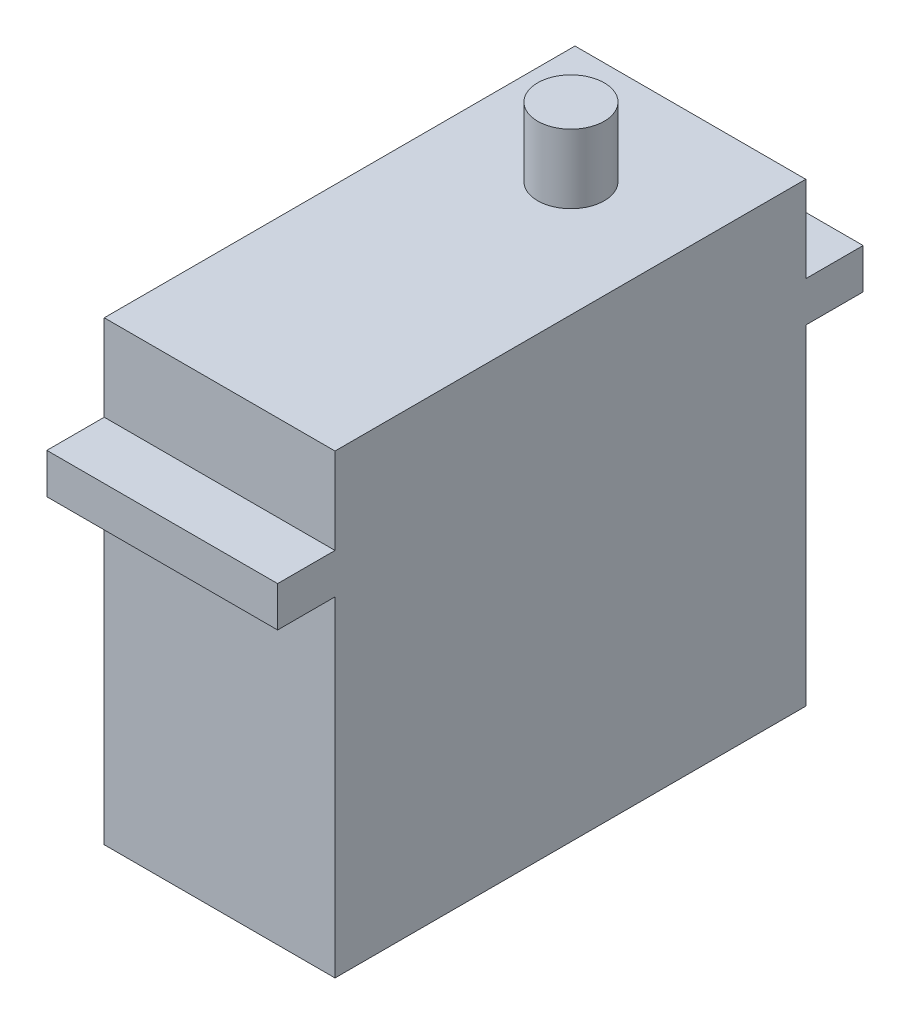
ISO-10303-21;
HEADER;
FILE_DESCRIPTION(('STEP AP214'),'2;1');
FILE_NAME('part.step','',(''),(''),'','','');
FILE_SCHEMA(('AUTOMOTIVE_DESIGN { 1 0 10303 214 1 1 1 1 }'));
ENDSEC;
DATA;
#1=APPLICATION_CONTEXT('core data for automotive mechanical design processes');
#2=APPLICATION_PROTOCOL_DEFINITION('international standard','automotive_design',2000,#1);
#3=PRODUCT_CONTEXT('',#1,'mechanical');
#4=PRODUCT('Part','Part','',(#3));
#5=PRODUCT_RELATED_PRODUCT_CATEGORY('part','',(#4));
#6=PRODUCT_DEFINITION_FORMATION('','',#4);
#7=PRODUCT_DEFINITION_CONTEXT('part definition',#1,'design');
#8=PRODUCT_DEFINITION('design','',#6,#7);
#9=PRODUCT_DEFINITION_SHAPE('','',#8);
#10=(LENGTH_UNIT() NAMED_UNIT(*) SI_UNIT(.MILLI.,.METRE.));
#11=(NAMED_UNIT(*) PLANE_ANGLE_UNIT() SI_UNIT($,.RADIAN.));
#12=(NAMED_UNIT(*) SI_UNIT($,.STERADIAN.) SOLID_ANGLE_UNIT());
#13=UNCERTAINTY_MEASURE_WITH_UNIT(LENGTH_MEASURE(1.E-05),#10,'distance_accuracy_value','');
#14=(GEOMETRIC_REPRESENTATION_CONTEXT(3) GLOBAL_UNCERTAINTY_ASSIGNED_CONTEXT((#13)) GLOBAL_UNIT_ASSIGNED_CONTEXT((#10,
#11,#12)) REPRESENTATION_CONTEXT('',''));
#15=CARTESIAN_POINT('',(0.,0.,0.));
#16=DIRECTION('',(0.,0.,1.));
#17=DIRECTION('',(1.,0.,0.));
#18=AXIS2_PLACEMENT_3D('',#15,#16,#17);
#19=CARTESIAN_POINT('',(20.1,0.,0.));
#20=DIRECTION('',(1.,0.,0.));
#21=DIRECTION('',(0.,0.,-1.));
#22=AXIS2_PLACEMENT_3D('',#19,#20,#21);
#23=PLANE('',#22);
#24=DIRECTION('',(0.,0.,-1.));
#25=VECTOR('',#24,1.);
#26=CARTESIAN_POINT('',(20.1,19.875,0.));
#27=LINE('',#26,#25);
#28=CARTESIAN_POINT('',(20.1,19.875,20.5));
#29=VERTEX_POINT('',#28);
#30=CARTESIAN_POINT('',(20.1,19.875,-20.5));
#31=VERTEX_POINT('',#30);
#32=EDGE_CURVE('E239',#29,#31,#27,.T.);
#33=ORIENTED_EDGE('',*,*,#32,.F.);
#34=DIRECTION('',(0.,-1.,0.));
#35=VECTOR('',#34,1.);
#36=CARTESIAN_POINT('',(20.1,0.,20.5));
#37=LINE('',#36,#35);
#38=CARTESIAN_POINT('',(20.1,12.375,20.5));
#39=VERTEX_POINT('',#38);
#40=EDGE_CURVE('E230',#29,#39,#37,.T.);
#41=ORIENTED_EDGE('',*,*,#40,.T.);
#42=DIRECTION('',(0.,0.,1.));
#43=VECTOR('',#42,1.);
#44=CARTESIAN_POINT('',(20.1,12.375,0.));
#45=LINE('',#44,#43);
#46=CARTESIAN_POINT('',(20.1,12.375,25.5));
#47=VERTEX_POINT('',#46);
#48=EDGE_CURVE('E306',#39,#47,#45,.T.);
#49=ORIENTED_EDGE('',*,*,#48,.T.);
#50=DIRECTION('',(0.,-1.,0.));
#51=VECTOR('',#50,1.);
#52=CARTESIAN_POINT('',(20.1,0.,25.5));
#53=LINE('',#52,#51);
#54=CARTESIAN_POINT('',(20.1,8.87500000000001,25.5));
#55=VERTEX_POINT('',#54);
#56=EDGE_CURVE('E302',#47,#55,#53,.T.);
#57=ORIENTED_EDGE('',*,*,#56,.T.);
#58=DIRECTION('',(0.,0.,1.));
#59=VECTOR('',#58,1.);
#60=CARTESIAN_POINT('',(20.1,8.87500000000004,0.));
#61=LINE('',#60,#59);
#62=CARTESIAN_POINT('',(20.1,8.87500000000001,20.5));
#63=VERTEX_POINT('',#62);
#64=EDGE_CURVE('E296',#63,#55,#61,.T.);
#65=ORIENTED_EDGE('',*,*,#64,.F.);
#66=CARTESIAN_POINT('',(20.1,-19.875,20.5));
#67=VERTEX_POINT('',#66);
#68=EDGE_CURVE('E291',#63,#67,#37,.T.);
#69=ORIENTED_EDGE('',*,*,#68,.T.);
#70=DIRECTION('',(0.,0.,-1.));
#71=VECTOR('',#70,1.);
#72=CARTESIAN_POINT('',(20.1,-19.875,0.));
#73=LINE('',#72,#71);
#74=CARTESIAN_POINT('',(20.1,-19.875,-20.5));
#75=VERTEX_POINT('',#74);
#76=EDGE_CURVE('E288',#67,#75,#73,.T.);
#77=ORIENTED_EDGE('',*,*,#76,.T.);
#78=DIRECTION('',(0.,-1.,0.));
#79=VECTOR('',#78,1.);
#80=CARTESIAN_POINT('',(20.1,0.,-20.5));
#81=LINE('',#80,#79);
#82=CARTESIAN_POINT('',(20.1,8.87500000000001,-20.5));
#83=VERTEX_POINT('',#82);
#84=EDGE_CURVE('E162',#83,#75,#81,.T.);
#85=ORIENTED_EDGE('',*,*,#84,.F.);
#86=DIRECTION('',(0.,0.,-1.));
#87=VECTOR('',#86,1.);
#88=CARTESIAN_POINT('',(20.1,8.87500000000004,0.));
#89=LINE('',#88,#87);
#90=CARTESIAN_POINT('',(20.1,8.87500000000001,-25.5));
#91=VERTEX_POINT('',#90);
#92=EDGE_CURVE('E156',#83,#91,#89,.T.);
#93=ORIENTED_EDGE('',*,*,#92,.T.);
#94=DIRECTION('',(0.,-1.,0.));
#95=VECTOR('',#94,1.);
#96=CARTESIAN_POINT('',(20.1,0.,-25.5));
#97=LINE('',#96,#95);
#98=CARTESIAN_POINT('',(20.1,12.375,-25.5));
#99=VERTEX_POINT('',#98);
#100=EDGE_CURVE('E160',#99,#91,#97,.T.);
#101=ORIENTED_EDGE('',*,*,#100,.F.);
#102=DIRECTION('',(0.,0.,-1.));
#103=VECTOR('',#102,1.);
#104=CARTESIAN_POINT('',(20.1,12.375,0.));
#105=LINE('',#104,#103);
#106=CARTESIAN_POINT('',(20.1,12.375,-20.5));
#107=VERTEX_POINT('',#106);
#108=EDGE_CURVE('E175',#107,#99,#105,.T.);
#109=ORIENTED_EDGE('',*,*,#108,.F.);
#110=EDGE_CURVE('E206',#31,#107,#81,.T.);
#111=ORIENTED_EDGE('',*,*,#110,.F.);
#112=EDGE_LOOP('',(#33,#41,#49,#57,#65,#69,#77,#85,#93,#101,#109,#111));
#113=FACE_BOUND('',#112,.T.);
#114=ADVANCED_FACE('F63',(#113),#23,.T.);
#115=CARTESIAN_POINT('',(20.1,25.875,0.));
#116=DIRECTION('',(0.,1.,0.));
#117=DIRECTION('',(0.,0.,1.));
#118=AXIS2_PLACEMENT_3D('',#115,#116,#117);
#119=PLANE('',#118);
#120=CARTESIAN_POINT('',(10.05,25.875,-10.1));
#121=DIRECTION('',(0.,1.,0.));
#122=DIRECTION('',(0.,0.,1.));
#123=AXIS2_PLACEMENT_3D('',#120,#121,#122);
#124=CIRCLE('',#123,2.9);
#125=CARTESIAN_POINT('',(10.05,25.875,-7.19999999999999));
#126=VERTEX_POINT('',#125);
#127=EDGE_CURVE('E183',#126,#126,#124,.T.);
#128=ORIENTED_EDGE('',*,*,#127,.T.);
#129=EDGE_LOOP('',(#128));
#130=FACE_BOUND('',#129,.T.);
#131=ADVANCED_FACE('F65',(#130),#119,.T.);
#132=CARTESIAN_POINT('',(0.,0.,0.));
#133=DIRECTION('',(1.,0.,0.));
#134=DIRECTION('',(0.,0.,-1.));
#135=AXIS2_PLACEMENT_3D('',#132,#133,#134);
#136=PLANE('',#135);
#137=DIRECTION('',(0.,0.,-1.));
#138=VECTOR('',#137,1.);
#139=CARTESIAN_POINT('',(0.,19.875,0.));
#140=LINE('',#139,#138);
#141=CARTESIAN_POINT('',(0.,19.875,20.5));
#142=VERTEX_POINT('',#141);
#143=CARTESIAN_POINT('',(0.,19.875,-20.5));
#144=VERTEX_POINT('',#143);
#145=EDGE_CURVE('E182',#142,#144,#140,.T.);
#146=ORIENTED_EDGE('',*,*,#145,.T.);
#147=DIRECTION('',(0.,-1.,0.));
#148=VECTOR('',#147,1.);
#149=CARTESIAN_POINT('',(0.,0.,-20.5));
#150=LINE('',#149,#148);
#151=CARTESIAN_POINT('',(0.,12.375,-20.5));
#152=VERTEX_POINT('',#151);
#153=EDGE_CURVE('E180',#144,#152,#150,.T.);
#154=ORIENTED_EDGE('',*,*,#153,.T.);
#155=DIRECTION('',(0.,0.,-1.));
#156=VECTOR('',#155,1.);
#157=CARTESIAN_POINT('',(0.,12.375,0.));
#158=LINE('',#157,#156);
#159=CARTESIAN_POINT('',(0.,12.375,-25.5));
#160=VERTEX_POINT('',#159);
#161=EDGE_CURVE('E203',#152,#160,#158,.T.);
#162=ORIENTED_EDGE('',*,*,#161,.T.);
#163=DIRECTION('',(0.,-1.,0.));
#164=VECTOR('',#163,1.);
#165=CARTESIAN_POINT('',(0.,0.,-25.5));
#166=LINE('',#165,#164);
#167=CARTESIAN_POINT('',(0.,8.87500000000001,-25.5));
#168=VERTEX_POINT('',#167);
#169=EDGE_CURVE('E201',#160,#168,#166,.T.);
#170=ORIENTED_EDGE('',*,*,#169,.T.);
#171=DIRECTION('',(0.,0.,-1.));
#172=VECTOR('',#171,1.);
#173=CARTESIAN_POINT('',(0.,8.87500000000004,0.));
#174=LINE('',#173,#172);
#175=CARTESIAN_POINT('',(0.,8.87500000000001,-20.5));
#176=VERTEX_POINT('',#175);
#177=EDGE_CURVE('E169',#176,#168,#174,.T.);
#178=ORIENTED_EDGE('',*,*,#177,.F.);
#179=CARTESIAN_POINT('',(0.,-19.875,-20.5));
#180=VERTEX_POINT('',#179);
#181=EDGE_CURVE('E184',#176,#180,#150,.T.);
#182=ORIENTED_EDGE('',*,*,#181,.T.);
#183=DIRECTION('',(0.,0.,-1.));
#184=VECTOR('',#183,1.);
#185=CARTESIAN_POINT('',(0.,-19.875,0.));
#186=LINE('',#185,#184);
#187=CARTESIAN_POINT('',(0.,-19.875,20.5));
#188=VERTEX_POINT('',#187);
#189=EDGE_CURVE('E197',#188,#180,#186,.T.);
#190=ORIENTED_EDGE('',*,*,#189,.F.);
#191=DIRECTION('',(0.,-1.,0.));
#192=VECTOR('',#191,1.);
#193=CARTESIAN_POINT('',(0.,0.,20.5));
#194=LINE('',#193,#192);
#195=CARTESIAN_POINT('',(0.,8.87500000000001,20.5));
#196=VERTEX_POINT('',#195);
#197=EDGE_CURVE('E189',#196,#188,#194,.T.);
#198=ORIENTED_EDGE('',*,*,#197,.F.);
#199=DIRECTION('',(0.,0.,1.));
#200=VECTOR('',#199,1.);
#201=CARTESIAN_POINT('',(0.,8.87500000000004,0.));
#202=LINE('',#201,#200);
#203=CARTESIAN_POINT('',(0.,8.87500000000001,25.5));
#204=VERTEX_POINT('',#203);
#205=EDGE_CURVE('E194',#196,#204,#202,.T.);
#206=ORIENTED_EDGE('',*,*,#205,.T.);
#207=DIRECTION('',(0.,-1.,0.));
#208=VECTOR('',#207,1.);
#209=CARTESIAN_POINT('',(0.,0.,25.5));
#210=LINE('',#209,#208);
#211=CARTESIAN_POINT('',(0.,12.375,25.5));
#212=VERTEX_POINT('',#211);
#213=EDGE_CURVE('E191',#212,#204,#210,.T.);
#214=ORIENTED_EDGE('',*,*,#213,.F.);
#215=DIRECTION('',(0.,0.,1.));
#216=VECTOR('',#215,1.);
#217=CARTESIAN_POINT('',(0.,12.375,0.));
#218=LINE('',#217,#216);
#219=CARTESIAN_POINT('',(0.,12.375,20.5));
#220=VERTEX_POINT('',#219);
#221=EDGE_CURVE('E188',#220,#212,#218,.T.);
#222=ORIENTED_EDGE('',*,*,#221,.F.);
#223=EDGE_CURVE('E186',#142,#220,#194,.T.);
#224=ORIENTED_EDGE('',*,*,#223,.F.);
#225=EDGE_LOOP('',(#146,#154,#162,#170,#178,#182,#190,#198,#206,#214,#222,#224));
#226=FACE_BOUND('',#225,.T.);
#227=ADVANCED_FACE('F236',(#226),#136,.F.);
#228=CARTESIAN_POINT('',(20.1,0.,-20.5));
#229=DIRECTION('',(0.,0.,-1.));
#230=DIRECTION('',(0.,1.,0.));
#231=AXIS2_PLACEMENT_3D('',#228,#229,#230);
#232=PLANE('',#231);
#233=ORIENTED_EDGE('',*,*,#153,.F.);
#234=DIRECTION('',(-1.,0.,0.));
#235=VECTOR('',#234,1.);
#236=CARTESIAN_POINT('',(20.1,19.875,-20.5));
#237=LINE('',#236,#235);
#238=EDGE_CURVE('E12',#31,#144,#237,.T.);
#239=ORIENTED_EDGE('',*,*,#238,.F.);
#240=ORIENTED_EDGE('',*,*,#110,.T.);
#241=DIRECTION('',(-1.,0.,0.));
#242=VECTOR('',#241,1.);
#243=CARTESIAN_POINT('',(20.1,12.375,-20.5));
#244=LINE('',#243,#242);
#245=EDGE_CURVE('E80',#107,#152,#244,.T.);
#246=ORIENTED_EDGE('',*,*,#245,.T.);
#247=EDGE_LOOP('',(#233,#239,#240,#246));
#248=FACE_BOUND('',#247,.T.);
#249=ADVANCED_FACE('F240',(#248),#232,.T.);
#250=CARTESIAN_POINT('',(20.1,19.875,0.));
#251=DIRECTION('',(0.,1.,0.));
#252=DIRECTION('',(0.,0.,1.));
#253=AXIS2_PLACEMENT_3D('',#250,#251,#252);
#254=PLANE('',#253);
#255=CARTESIAN_POINT('',(10.05,19.875,-10.1));
#256=DIRECTION('',(0.,1.,0.));
#257=DIRECTION('',(0.,0.,1.));
#258=AXIS2_PLACEMENT_3D('',#255,#256,#257);
#259=CIRCLE('',#258,2.9);
#260=CARTESIAN_POINT('',(10.05,19.875,-7.19999999999999));
#261=VERTEX_POINT('',#260);
#262=EDGE_CURVE('E316',#261,#261,#259,.T.);
#263=ORIENTED_EDGE('',*,*,#262,.F.);
#264=EDGE_LOOP('',(#263));
#265=FACE_BOUND('',#264,.T.);
#266=ORIENTED_EDGE('',*,*,#145,.F.);
#267=DIRECTION('',(-1.,0.,0.));
#268=VECTOR('',#267,1.);
#269=CARTESIAN_POINT('',(20.1,19.875,20.5));
#270=LINE('',#269,#268);
#271=EDGE_CURVE('E72',#29,#142,#270,.T.);
#272=ORIENTED_EDGE('',*,*,#271,.F.);
#273=ORIENTED_EDGE('',*,*,#32,.T.);
#274=ORIENTED_EDGE('',*,*,#238,.T.);
#275=EDGE_LOOP('',(#266,#272,#273,#274));
#276=FACE_BOUND('',#275,.T.);
#277=ADVANCED_FACE('F238',(#265,#276),#254,.T.);
#278=CARTESIAN_POINT('',(20.1,0.,20.5));
#279=DIRECTION('',(0.,0.,-1.));
#280=DIRECTION('',(0.,1.,0.));
#281=AXIS2_PLACEMENT_3D('',#278,#279,#280);
#282=PLANE('',#281);
#283=ORIENTED_EDGE('',*,*,#223,.T.);
#284=DIRECTION('',(-1.,0.,0.));
#285=VECTOR('',#284,1.);
#286=CARTESIAN_POINT('',(20.1,12.375,20.5));
#287=LINE('',#286,#285);
#288=EDGE_CURVE('E222',#39,#220,#287,.T.);
#289=ORIENTED_EDGE('',*,*,#288,.F.);
#290=ORIENTED_EDGE('',*,*,#40,.F.);
#291=ORIENTED_EDGE('',*,*,#271,.T.);
#292=EDGE_LOOP('',(#283,#289,#290,#291));
#293=FACE_BOUND('',#292,.T.);
#294=ADVANCED_FACE('F228',(#293),#282,.F.);
#295=CARTESIAN_POINT('',(20.1,12.375,0.));
#296=DIRECTION('',(0.,-1.,0.));
#297=DIRECTION('',(0.,0.,-1.));
#298=AXIS2_PLACEMENT_3D('',#295,#296,#297);
#299=PLANE('',#298);
#300=ORIENTED_EDGE('',*,*,#221,.T.);
#301=DIRECTION('',(-1.,0.,0.));
#302=VECTOR('',#301,1.);
#303=CARTESIAN_POINT('',(20.1,12.375,25.5));
#304=LINE('',#303,#302);
#305=EDGE_CURVE('E219',#47,#212,#304,.T.);
#306=ORIENTED_EDGE('',*,*,#305,.F.);
#307=ORIENTED_EDGE('',*,*,#48,.F.);
#308=ORIENTED_EDGE('',*,*,#288,.T.);
#309=EDGE_LOOP('',(#300,#306,#307,#308));
#310=FACE_BOUND('',#309,.T.);
#311=ADVANCED_FACE('F305',(#310),#299,.F.);
#312=CARTESIAN_POINT('',(20.1,0.,25.5));
#313=DIRECTION('',(0.,0.,-1.));
#314=DIRECTION('',(-1.,0.,0.));
#315=AXIS2_PLACEMENT_3D('',#312,#313,#314);
#316=PLANE('',#315);
#317=ORIENTED_EDGE('',*,*,#213,.T.);
#318=DIRECTION('',(-1.,0.,0.));
#319=VECTOR('',#318,1.);
#320=CARTESIAN_POINT('',(20.1,8.87500000000001,25.5));
#321=LINE('',#320,#319);
#322=EDGE_CURVE('E217',#55,#204,#321,.T.);
#323=ORIENTED_EDGE('',*,*,#322,.F.);
#324=ORIENTED_EDGE('',*,*,#56,.F.);
#325=ORIENTED_EDGE('',*,*,#305,.T.);
#326=EDGE_LOOP('',(#317,#323,#324,#325));
#327=FACE_BOUND('',#326,.T.);
#328=ADVANCED_FACE('F299',(#327),#316,.F.);
#329=CARTESIAN_POINT('',(20.1,8.87500000000004,0.));
#330=DIRECTION('',(0.,-1.,0.));
#331=DIRECTION('',(0.,0.,-1.));
#332=AXIS2_PLACEMENT_3D('',#329,#330,#331);
#333=PLANE('',#332);
#334=ORIENTED_EDGE('',*,*,#205,.F.);
#335=DIRECTION('',(-1.,0.,0.));
#336=VECTOR('',#335,1.);
#337=CARTESIAN_POINT('',(20.1,8.87500000000001,20.5));
#338=LINE('',#337,#336);
#339=EDGE_CURVE('E215',#63,#196,#338,.T.);
#340=ORIENTED_EDGE('',*,*,#339,.F.);
#341=ORIENTED_EDGE('',*,*,#64,.T.);
#342=ORIENTED_EDGE('',*,*,#322,.T.);
#343=EDGE_LOOP('',(#334,#340,#341,#342));
#344=FACE_BOUND('',#343,.T.);
#345=ADVANCED_FACE('F295',(#344),#333,.T.);
#346=ORIENTED_EDGE('',*,*,#197,.T.);
#347=DIRECTION('',(-1.,0.,0.));
#348=VECTOR('',#347,1.);
#349=CARTESIAN_POINT('',(20.1,-19.875,20.5));
#350=LINE('',#349,#348);
#351=EDGE_CURVE('E212',#67,#188,#350,.T.);
#352=ORIENTED_EDGE('',*,*,#351,.F.);
#353=ORIENTED_EDGE('',*,*,#68,.F.);
#354=ORIENTED_EDGE('',*,*,#339,.T.);
#355=EDGE_LOOP('',(#346,#352,#353,#354));
#356=FACE_BOUND('',#355,.T.);
#357=ADVANCED_FACE('F278',(#356),#282,.F.);
#358=CARTESIAN_POINT('',(20.1,-19.875,0.));
#359=DIRECTION('',(0.,1.,0.));
#360=DIRECTION('',(0.,0.,1.));
#361=AXIS2_PLACEMENT_3D('',#358,#359,#360);
#362=PLANE('',#361);
#363=ORIENTED_EDGE('',*,*,#189,.T.);
#364=DIRECTION('',(-1.,0.,0.));
#365=VECTOR('',#364,1.);
#366=CARTESIAN_POINT('',(20.1,-19.875,-20.5));
#367=LINE('',#366,#365);
#368=EDGE_CURVE('E210',#75,#180,#367,.T.);
#369=ORIENTED_EDGE('',*,*,#368,.F.);
#370=ORIENTED_EDGE('',*,*,#76,.F.);
#371=ORIENTED_EDGE('',*,*,#351,.T.);
#372=EDGE_LOOP('',(#363,#369,#370,#371));
#373=FACE_BOUND('',#372,.T.);
#374=ADVANCED_FACE('F272',(#373),#362,.F.);
#375=ORIENTED_EDGE('',*,*,#181,.F.);
#376=DIRECTION('',(-1.,0.,0.));
#377=VECTOR('',#376,1.);
#378=CARTESIAN_POINT('',(20.1,8.87500000000001,-20.5));
#379=LINE('',#378,#377);
#380=EDGE_CURVE('E172',#83,#176,#379,.T.);
#381=ORIENTED_EDGE('',*,*,#380,.F.);
#382=ORIENTED_EDGE('',*,*,#84,.T.);
#383=ORIENTED_EDGE('',*,*,#368,.T.);
#384=EDGE_LOOP('',(#375,#381,#382,#383));
#385=FACE_BOUND('',#384,.T.);
#386=ADVANCED_FACE('F264',(#385),#232,.T.);
#387=CARTESIAN_POINT('',(20.1,8.87500000000004,0.));
#388=DIRECTION('',(0.,1.,0.));
#389=DIRECTION('',(0.,0.,1.));
#390=AXIS2_PLACEMENT_3D('',#387,#388,#389);
#391=PLANE('',#390);
#392=ORIENTED_EDGE('',*,*,#177,.T.);
#393=DIRECTION('',(-1.,0.,0.));
#394=VECTOR('',#393,1.);
#395=CARTESIAN_POINT('',(20.1,8.87500000000001,-25.5));
#396=LINE('',#395,#394);
#397=EDGE_CURVE('E166',#91,#168,#396,.T.);
#398=ORIENTED_EDGE('',*,*,#397,.F.);
#399=ORIENTED_EDGE('',*,*,#92,.F.);
#400=ORIENTED_EDGE('',*,*,#380,.T.);
#401=EDGE_LOOP('',(#392,#398,#399,#400));
#402=FACE_BOUND('',#401,.T.);
#403=ADVANCED_FACE('F167',(#402),#391,.F.);
#404=CARTESIAN_POINT('',(20.1,0.,-25.5));
#405=DIRECTION('',(0.,0.,-1.));
#406=DIRECTION('',(-1.,0.,0.));
#407=AXIS2_PLACEMENT_3D('',#404,#405,#406);
#408=PLANE('',#407);
#409=ORIENTED_EDGE('',*,*,#169,.F.);
#410=DIRECTION('',(-1.,0.,0.));
#411=VECTOR('',#410,1.);
#412=CARTESIAN_POINT('',(20.1,12.375,-25.5));
#413=LINE('',#412,#411);
#414=EDGE_CURVE('E118',#99,#160,#413,.T.);
#415=ORIENTED_EDGE('',*,*,#414,.F.);
#416=ORIENTED_EDGE('',*,*,#100,.T.);
#417=ORIENTED_EDGE('',*,*,#397,.T.);
#418=EDGE_LOOP('',(#409,#415,#416,#417));
#419=FACE_BOUND('',#418,.T.);
#420=ADVANCED_FACE('F174',(#419),#408,.T.);
#421=CARTESIAN_POINT('',(20.1,12.375,0.));
#422=DIRECTION('',(0.,1.,0.));
#423=DIRECTION('',(0.,0.,1.));
#424=AXIS2_PLACEMENT_3D('',#421,#422,#423);
#425=PLANE('',#424);
#426=ORIENTED_EDGE('',*,*,#161,.F.);
#427=ORIENTED_EDGE('',*,*,#245,.F.);
#428=ORIENTED_EDGE('',*,*,#108,.T.);
#429=ORIENTED_EDGE('',*,*,#414,.T.);
#430=EDGE_LOOP('',(#426,#427,#428,#429));
#431=FACE_BOUND('',#430,.T.);
#432=ADVANCED_FACE('F241',(#431),#425,.T.);
#433=CARTESIAN_POINT('',(10.05,37.4785554895902,-10.1));
#434=DIRECTION('',(0.,-1.,0.));
#435=DIRECTION('',(0.,0.,-1.));
#436=AXIS2_PLACEMENT_3D('',#433,#434,#435);
#437=CYLINDRICAL_SURFACE('',#436,2.9);
#438=ORIENTED_EDGE('',*,*,#262,.T.);
#439=EDGE_LOOP('',(#438));
#440=FACE_BOUND('',#439,.T.);
#441=ORIENTED_EDGE('',*,*,#127,.F.);
#442=EDGE_LOOP('',(#441));
#443=FACE_BOUND('',#442,.T.);
#444=ADVANCED_FACE('F243',(#440,#443),#437,.T.);
#445=CLOSED_SHELL('',(#114,#131,#227,#249,#277,#294,#311,#328,#345,#357,#374,#386,#403,#420,
#432,#444));
#446=MANIFOLD_SOLID_BREP('B2',#445);
#447=ADVANCED_BREP_SHAPE_REPRESENTATION('',(#18,#446),#14);
#448=SHAPE_DEFINITION_REPRESENTATION(#9,#447);
ENDSEC;
END-ISO-10303-21;
